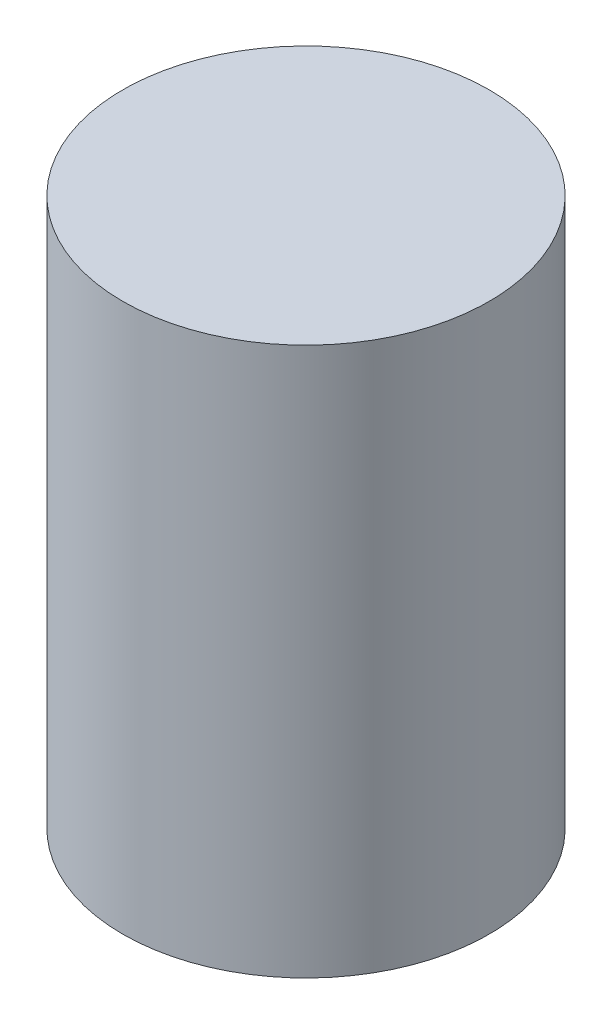
ISO-10303-21;
HEADER;
FILE_DESCRIPTION(('STEP AP214'),'2;1');
FILE_NAME('part.step','',(''),(''),'','','');
FILE_SCHEMA(('AUTOMOTIVE_DESIGN { 1 0 10303 214 1 1 1 1 }'));
ENDSEC;
DATA;
#1=APPLICATION_CONTEXT('core data for automotive mechanical design processes');
#2=APPLICATION_PROTOCOL_DEFINITION('international standard','automotive_design',2000,#1);
#3=PRODUCT_CONTEXT('',#1,'mechanical');
#4=PRODUCT('Part','Part','',(#3));
#5=PRODUCT_RELATED_PRODUCT_CATEGORY('part','',(#4));
#6=PRODUCT_DEFINITION_FORMATION('','',#4);
#7=PRODUCT_DEFINITION_CONTEXT('part definition',#1,'design');
#8=PRODUCT_DEFINITION('design','',#6,#7);
#9=PRODUCT_DEFINITION_SHAPE('','',#8);
#10=(LENGTH_UNIT() NAMED_UNIT(*) SI_UNIT(.MILLI.,.METRE.));
#11=(NAMED_UNIT(*) PLANE_ANGLE_UNIT() SI_UNIT($,.RADIAN.));
#12=(NAMED_UNIT(*) SI_UNIT($,.STERADIAN.) SOLID_ANGLE_UNIT());
#13=UNCERTAINTY_MEASURE_WITH_UNIT(LENGTH_MEASURE(1.E-05),#10,'distance_accuracy_value','');
#14=(GEOMETRIC_REPRESENTATION_CONTEXT(3) GLOBAL_UNCERTAINTY_ASSIGNED_CONTEXT((#13)) GLOBAL_UNIT_ASSIGNED_CONTEXT((#10,
#11,#12)) REPRESENTATION_CONTEXT('',''));
#15=CARTESIAN_POINT('',(0.,0.,0.));
#16=DIRECTION('',(0.,0.,1.));
#17=DIRECTION('',(1.,0.,0.));
#18=AXIS2_PLACEMENT_3D('',#15,#16,#17);
#19=CARTESIAN_POINT('',(0.,66.548,0.));
#20=DIRECTION('',(0.,-1.,0.));
#21=DIRECTION('',(0.,0.,-1.));
#22=AXIS2_PLACEMENT_3D('',#19,#20,#21);
#23=CYLINDRICAL_SURFACE('',#22,22.2504);
#24=CARTESIAN_POINT('',(0.,66.548,0.));
#25=DIRECTION('',(0.,1.,0.));
#26=DIRECTION('',(0.,0.,1.));
#27=AXIS2_PLACEMENT_3D('',#24,#25,#26);
#28=CIRCLE('',#27,22.2504);
#29=CARTESIAN_POINT('',(0.,66.548,22.2504));
#30=VERTEX_POINT('',#29);
#31=EDGE_CURVE('E10',#30,#30,#28,.T.);
#32=ORIENTED_EDGE('',*,*,#31,.F.);
#33=EDGE_LOOP('',(#32));
#34=FACE_BOUND('',#33,.T.);
#35=CARTESIAN_POINT('',(0.,0.,0.));
#36=DIRECTION('',(0.,1.,0.));
#37=DIRECTION('',(0.,0.,1.));
#38=AXIS2_PLACEMENT_3D('',#35,#36,#37);
#39=CIRCLE('',#38,22.2504);
#40=CARTESIAN_POINT('',(0.,0.,22.2504));
#41=VERTEX_POINT('',#40);
#42=EDGE_CURVE('E33',#41,#41,#39,.T.);
#43=ORIENTED_EDGE('',*,*,#42,.T.);
#44=EDGE_LOOP('',(#43));
#45=FACE_BOUND('',#44,.T.);
#46=ADVANCED_FACE('F30',(#34,#45),#23,.T.);
#47=CARTESIAN_POINT('',(0.,66.548,0.));
#48=DIRECTION('',(0.,1.,0.));
#49=DIRECTION('',(0.,0.,1.));
#50=AXIS2_PLACEMENT_3D('',#47,#48,#49);
#51=PLANE('',#50);
#52=ORIENTED_EDGE('',*,*,#31,.T.);
#53=EDGE_LOOP('',(#52));
#54=FACE_BOUND('',#53,.T.);
#55=ADVANCED_FACE('F45',(#54),#51,.T.);
#56=CARTESIAN_POINT('',(0.,0.,0.));
#57=DIRECTION('',(0.,1.,0.));
#58=DIRECTION('',(0.,0.,1.));
#59=AXIS2_PLACEMENT_3D('',#56,#57,#58);
#60=PLANE('',#59);
#61=ORIENTED_EDGE('',*,*,#42,.F.);
#62=EDGE_LOOP('',(#61));
#63=FACE_BOUND('',#62,.T.);
#64=ADVANCED_FACE('F43',(#63),#60,.F.);
#65=CLOSED_SHELL('',(#46,#55,#64));
#66=MANIFOLD_SOLID_BREP('B2',#65);
#67=ADVANCED_BREP_SHAPE_REPRESENTATION('',(#18,#66),#14);
#68=SHAPE_DEFINITION_REPRESENTATION(#9,#67);
ENDSEC;
END-ISO-10303-21;
